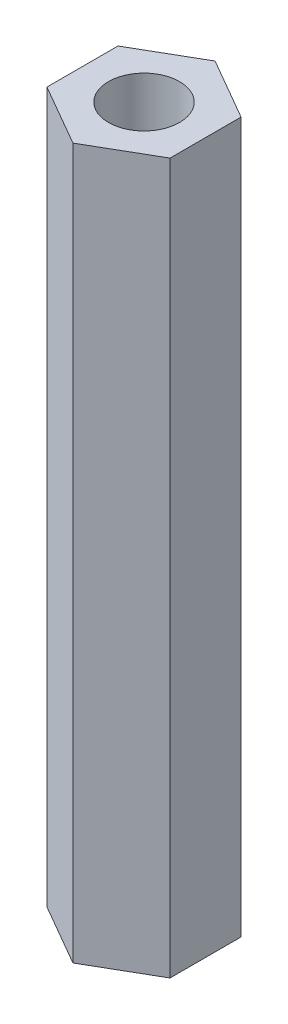
ISO-10303-21;
HEADER;
FILE_DESCRIPTION(('STEP AP214'),'2;1');
FILE_NAME('part.step','',(''),(''),'','','');
FILE_SCHEMA(('AUTOMOTIVE_DESIGN { 1 0 10303 214 1 1 1 1 }'));
ENDSEC;
DATA;
#1=APPLICATION_CONTEXT('core data for automotive mechanical design processes');
#2=APPLICATION_PROTOCOL_DEFINITION('international standard','automotive_design',2000,#1);
#3=PRODUCT_CONTEXT('',#1,'mechanical');
#4=PRODUCT('Part','Part','',(#3));
#5=PRODUCT_RELATED_PRODUCT_CATEGORY('part','',(#4));
#6=PRODUCT_DEFINITION_FORMATION('','',#4);
#7=PRODUCT_DEFINITION_CONTEXT('part definition',#1,'design');
#8=PRODUCT_DEFINITION('design','',#6,#7);
#9=PRODUCT_DEFINITION_SHAPE('','',#8);
#10=(LENGTH_UNIT() NAMED_UNIT(*) SI_UNIT(.MILLI.,.METRE.));
#11=(NAMED_UNIT(*) PLANE_ANGLE_UNIT() SI_UNIT($,.RADIAN.));
#12=(NAMED_UNIT(*) SI_UNIT($,.STERADIAN.) SOLID_ANGLE_UNIT());
#13=UNCERTAINTY_MEASURE_WITH_UNIT(LENGTH_MEASURE(1.E-05),#10,'distance_accuracy_value','');
#14=(GEOMETRIC_REPRESENTATION_CONTEXT(3) GLOBAL_UNCERTAINTY_ASSIGNED_CONTEXT((#13)) GLOBAL_UNIT_ASSIGNED_CONTEXT((#10,
#11,#12)) REPRESENTATION_CONTEXT('',''));
#15=CARTESIAN_POINT('',(0.,0.,0.));
#16=DIRECTION('',(0.,0.,1.));
#17=DIRECTION('',(1.,0.,0.));
#18=AXIS2_PLACEMENT_3D('',#15,#16,#17);
#19=CARTESIAN_POINT('',(0.,30.,0.));
#20=DIRECTION('',(0.,1.,0.));
#21=DIRECTION('',(0.,0.,1.));
#22=AXIS2_PLACEMENT_3D('',#19,#20,#21);
#23=PLANE('',#22);
#24=DIRECTION('',(-0.866025403784439,0.,-0.499999999999999));
#25=VECTOR('',#24,1.);
#26=CARTESIAN_POINT('',(2.6,30.,-1.50111069989303));
#27=LINE('',#26,#25);
#28=CARTESIAN_POINT('',(2.6,30.,-1.50111069989303));
#29=VERTEX_POINT('',#28);
#30=CARTESIAN_POINT('',(0.,30.,-3.00222139978605));
#31=VERTEX_POINT('',#30);
#32=EDGE_CURVE('E150',#29,#31,#27,.T.);
#33=ORIENTED_EDGE('',*,*,#32,.T.);
#34=DIRECTION('',(-0.866025403784438,0.,0.500000000000001));
#35=VECTOR('',#34,1.);
#36=CARTESIAN_POINT('',(0.,30.,-3.00222139978605));
#37=LINE('',#36,#35);
#38=CARTESIAN_POINT('',(-2.6,30.,-1.50111069989303));
#39=VERTEX_POINT('',#38);
#40=EDGE_CURVE('E98',#31,#39,#37,.T.);
#41=ORIENTED_EDGE('',*,*,#40,.T.);
#42=DIRECTION('',(0.,0.,1.));
#43=VECTOR('',#42,1.);
#44=CARTESIAN_POINT('',(-2.6,30.,-1.50111069989303));
#45=LINE('',#44,#43);
#46=CARTESIAN_POINT('',(-2.6,30.,1.50111069989303));
#47=VERTEX_POINT('',#46);
#48=EDGE_CURVE('E111',#39,#47,#45,.T.);
#49=ORIENTED_EDGE('',*,*,#48,.T.);
#50=DIRECTION('',(0.866025403784437,0.,0.500000000000003));
#51=VECTOR('',#50,1.);
#52=CARTESIAN_POINT('',(-2.6,30.,1.50111069989303));
#53=LINE('',#52,#51);
#54=CARTESIAN_POINT('',(0.,30.,3.00222139978606));
#55=VERTEX_POINT('',#54);
#56=EDGE_CURVE('E105',#47,#55,#53,.T.);
#57=ORIENTED_EDGE('',*,*,#56,.T.);
#58=DIRECTION('',(0.866025403784438,0.,-0.5));
#59=VECTOR('',#58,1.);
#60=CARTESIAN_POINT('',(0.,30.,3.00222139978606));
#61=LINE('',#60,#59);
#62=CARTESIAN_POINT('',(2.6,30.,1.50111069989303));
#63=VERTEX_POINT('',#62);
#64=EDGE_CURVE('E109',#55,#63,#61,.T.);
#65=ORIENTED_EDGE('',*,*,#64,.T.);
#66=DIRECTION('',(0.,0.,-1.));
#67=VECTOR('',#66,1.);
#68=CARTESIAN_POINT('',(2.6,30.,1.50111069989303));
#69=LINE('',#68,#67);
#70=EDGE_CURVE('E61',#63,#29,#69,.T.);
#71=ORIENTED_EDGE('',*,*,#70,.T.);
#72=EDGE_LOOP('',(#33,#41,#49,#57,#65,#71));
#73=FACE_BOUND('',#72,.T.);
#74=CARTESIAN_POINT('',(0.,30.,0.));
#75=DIRECTION('',(0.,1.,0.));
#76=DIRECTION('',(0.,0.,1.));
#77=AXIS2_PLACEMENT_3D('',#74,#75,#76);
#78=CIRCLE('',#77,1.5);
#79=CARTESIAN_POINT('',(0.,30.,1.5));
#80=VERTEX_POINT('',#79);
#81=EDGE_CURVE('E138',#80,#80,#78,.T.);
#82=ORIENTED_EDGE('',*,*,#81,.F.);
#83=EDGE_LOOP('',(#82));
#84=FACE_BOUND('',#83,.T.);
#85=ADVANCED_FACE('F43',(#73,#84),#23,.T.);
#86=CARTESIAN_POINT('',(0.,0.,0.));
#87=DIRECTION('',(0.,1.,0.));
#88=DIRECTION('',(0.,0.,1.));
#89=AXIS2_PLACEMENT_3D('',#86,#87,#88);
#90=PLANE('',#89);
#91=DIRECTION('',(-0.866025403784439,0.,-0.499999999999999));
#92=VECTOR('',#91,1.);
#93=CARTESIAN_POINT('',(2.6,0.,-1.50111069989303));
#94=LINE('',#93,#92);
#95=CARTESIAN_POINT('',(2.6,0.,-1.50111069989303));
#96=VERTEX_POINT('',#95);
#97=CARTESIAN_POINT('',(0.,0.,-3.00222139978605));
#98=VERTEX_POINT('',#97);
#99=EDGE_CURVE('E133',#96,#98,#94,.T.);
#100=ORIENTED_EDGE('',*,*,#99,.F.);
#101=DIRECTION('',(0.,0.,-1.));
#102=VECTOR('',#101,1.);
#103=CARTESIAN_POINT('',(2.6,0.,1.50111069989303));
#104=LINE('',#103,#102);
#105=CARTESIAN_POINT('',(2.6,0.,1.50111069989303));
#106=VERTEX_POINT('',#105);
#107=EDGE_CURVE('E90',#106,#96,#104,.T.);
#108=ORIENTED_EDGE('',*,*,#107,.F.);
#109=DIRECTION('',(0.866025403784438,0.,-0.5));
#110=VECTOR('',#109,1.);
#111=CARTESIAN_POINT('',(0.,0.,3.00222139978606));
#112=LINE('',#111,#110);
#113=CARTESIAN_POINT('',(0.,0.,3.00222139978606));
#114=VERTEX_POINT('',#113);
#115=EDGE_CURVE('E84',#114,#106,#112,.T.);
#116=ORIENTED_EDGE('',*,*,#115,.F.);
#117=DIRECTION('',(0.866025403784437,0.,0.500000000000003));
#118=VECTOR('',#117,1.);
#119=CARTESIAN_POINT('',(-2.6,0.,1.50111069989303));
#120=LINE('',#119,#118);
#121=CARTESIAN_POINT('',(-2.6,0.,1.50111069989303));
#122=VERTEX_POINT('',#121);
#123=EDGE_CURVE('E120',#122,#114,#120,.T.);
#124=ORIENTED_EDGE('',*,*,#123,.F.);
#125=DIRECTION('',(0.,0.,1.));
#126=VECTOR('',#125,1.);
#127=CARTESIAN_POINT('',(-2.6,0.,-1.50111069989303));
#128=LINE('',#127,#126);
#129=CARTESIAN_POINT('',(-2.6,0.,-1.50111069989303));
#130=VERTEX_POINT('',#129);
#131=EDGE_CURVE('E141',#130,#122,#128,.T.);
#132=ORIENTED_EDGE('',*,*,#131,.F.);
#133=DIRECTION('',(-0.866025403784438,0.,0.500000000000001));
#134=VECTOR('',#133,1.);
#135=CARTESIAN_POINT('',(0.,0.,-3.00222139978605));
#136=LINE('',#135,#134);
#137=EDGE_CURVE('E137',#98,#130,#136,.T.);
#138=ORIENTED_EDGE('',*,*,#137,.F.);
#139=EDGE_LOOP('',(#100,#108,#116,#124,#132,#138));
#140=FACE_BOUND('',#139,.T.);
#141=CARTESIAN_POINT('',(0.,0.,0.));
#142=DIRECTION('',(0.,1.,0.));
#143=DIRECTION('',(0.,0.,1.));
#144=AXIS2_PLACEMENT_3D('',#141,#142,#143);
#145=CIRCLE('',#144,1.5);
#146=CARTESIAN_POINT('',(0.,0.,1.5));
#147=VERTEX_POINT('',#146);
#148=EDGE_CURVE('E265',#147,#147,#145,.T.);
#149=ORIENTED_EDGE('',*,*,#148,.T.);
#150=EDGE_LOOP('',(#149));
#151=FACE_BOUND('',#150,.T.);
#152=ADVANCED_FACE('F163',(#140,#151),#90,.F.);
#153=CARTESIAN_POINT('',(2.6,30.,-1.50111069989303));
#154=DIRECTION('',(-0.499999999999999,0.,0.866025403784439));
#155=DIRECTION('',(0.866025403784439,0.,0.499999999999999));
#156=AXIS2_PLACEMENT_3D('',#153,#154,#155);
#157=PLANE('',#156);
#158=ORIENTED_EDGE('',*,*,#99,.T.);
#159=DIRECTION('',(0.,-1.,0.));
#160=VECTOR('',#159,1.);
#161=CARTESIAN_POINT('',(0.,30.,-3.00222139978605));
#162=LINE('',#161,#160);
#163=EDGE_CURVE('E11',#31,#98,#162,.T.);
#164=ORIENTED_EDGE('',*,*,#163,.F.);
#165=ORIENTED_EDGE('',*,*,#32,.F.);
#166=DIRECTION('',(0.,-1.,0.));
#167=VECTOR('',#166,1.);
#168=CARTESIAN_POINT('',(2.6,30.,-1.50111069989303));
#169=LINE('',#168,#167);
#170=EDGE_CURVE('E129',#29,#96,#169,.T.);
#171=ORIENTED_EDGE('',*,*,#170,.T.);
#172=EDGE_LOOP('',(#158,#164,#165,#171));
#173=FACE_BOUND('',#172,.T.);
#174=ADVANCED_FACE('F45',(#173),#157,.F.);
#175=CARTESIAN_POINT('',(0.,30.,-3.00222139978605));
#176=DIRECTION('',(0.500000000000001,0.,0.866025403784438));
#177=DIRECTION('',(0.866025403784438,0.,-0.500000000000001));
#178=AXIS2_PLACEMENT_3D('',#175,#176,#177);
#179=PLANE('',#178);
#180=ORIENTED_EDGE('',*,*,#137,.T.);
#181=DIRECTION('',(0.,-1.,0.));
#182=VECTOR('',#181,1.);
#183=CARTESIAN_POINT('',(-2.6,30.,-1.50111069989303));
#184=LINE('',#183,#182);
#185=EDGE_CURVE('E53',#39,#130,#184,.T.);
#186=ORIENTED_EDGE('',*,*,#185,.F.);
#187=ORIENTED_EDGE('',*,*,#40,.F.);
#188=ORIENTED_EDGE('',*,*,#163,.T.);
#189=EDGE_LOOP('',(#180,#186,#187,#188));
#190=FACE_BOUND('',#189,.T.);
#191=ADVANCED_FACE('F188',(#190),#179,.F.);
#192=CARTESIAN_POINT('',(-2.6,30.,-1.50111069989303));
#193=DIRECTION('',(1.,0.,0.));
#194=DIRECTION('',(0.,0.,-1.));
#195=AXIS2_PLACEMENT_3D('',#192,#193,#194);
#196=PLANE('',#195);
#197=ORIENTED_EDGE('',*,*,#131,.T.);
#198=DIRECTION('',(0.,-1.,0.));
#199=VECTOR('',#198,1.);
#200=CARTESIAN_POINT('',(-2.6,30.,1.50111069989303));
#201=LINE('',#200,#199);
#202=EDGE_CURVE('E122',#47,#122,#201,.T.);
#203=ORIENTED_EDGE('',*,*,#202,.F.);
#204=ORIENTED_EDGE('',*,*,#48,.F.);
#205=ORIENTED_EDGE('',*,*,#185,.T.);
#206=EDGE_LOOP('',(#197,#203,#204,#205));
#207=FACE_BOUND('',#206,.T.);
#208=ADVANCED_FACE('F160',(#207),#196,.F.);
#209=CARTESIAN_POINT('',(-2.6,30.,1.50111069989303));
#210=DIRECTION('',(0.500000000000003,0.,-0.866025403784437));
#211=DIRECTION('',(-0.866025403784437,0.,-0.500000000000003));
#212=AXIS2_PLACEMENT_3D('',#209,#210,#211);
#213=PLANE('',#212);
#214=ORIENTED_EDGE('',*,*,#123,.T.);
#215=DIRECTION('',(0.,-1.,0.));
#216=VECTOR('',#215,1.);
#217=CARTESIAN_POINT('',(0.,30.,3.00222139978606));
#218=LINE('',#217,#216);
#219=EDGE_CURVE('E117',#55,#114,#218,.T.);
#220=ORIENTED_EDGE('',*,*,#219,.F.);
#221=ORIENTED_EDGE('',*,*,#56,.F.);
#222=ORIENTED_EDGE('',*,*,#202,.T.);
#223=EDGE_LOOP('',(#214,#220,#221,#222));
#224=FACE_BOUND('',#223,.T.);
#225=ADVANCED_FACE('F118',(#224),#213,.F.);
#226=CARTESIAN_POINT('',(0.,30.,3.00222139978606));
#227=DIRECTION('',(-0.5,0.,-0.866025403784438));
#228=DIRECTION('',(-0.866025403784439,0.,0.5));
#229=AXIS2_PLACEMENT_3D('',#226,#227,#228);
#230=PLANE('',#229);
#231=ORIENTED_EDGE('',*,*,#115,.T.);
#232=DIRECTION('',(0.,-1.,0.));
#233=VECTOR('',#232,1.);
#234=CARTESIAN_POINT('',(2.6,30.,1.50111069989303));
#235=LINE('',#234,#233);
#236=EDGE_CURVE('E123',#63,#106,#235,.T.);
#237=ORIENTED_EDGE('',*,*,#236,.F.);
#238=ORIENTED_EDGE('',*,*,#64,.F.);
#239=ORIENTED_EDGE('',*,*,#219,.T.);
#240=EDGE_LOOP('',(#231,#237,#238,#239));
#241=FACE_BOUND('',#240,.T.);
#242=ADVANCED_FACE('F125',(#241),#230,.F.);
#243=CARTESIAN_POINT('',(2.6,30.,1.50111069989303));
#244=DIRECTION('',(-1.,0.,0.));
#245=DIRECTION('',(0.,0.,1.));
#246=AXIS2_PLACEMENT_3D('',#243,#244,#245);
#247=PLANE('',#246);
#248=ORIENTED_EDGE('',*,*,#107,.T.);
#249=ORIENTED_EDGE('',*,*,#170,.F.);
#250=ORIENTED_EDGE('',*,*,#70,.F.);
#251=ORIENTED_EDGE('',*,*,#236,.T.);
#252=EDGE_LOOP('',(#248,#249,#250,#251));
#253=FACE_BOUND('',#252,.T.);
#254=ADVANCED_FACE('F168',(#253),#247,.F.);
#255=CARTESIAN_POINT('',(0.,30.,0.));
#256=DIRECTION('',(0.,-1.,0.));
#257=DIRECTION('',(0.,0.,-1.));
#258=AXIS2_PLACEMENT_3D('',#255,#256,#257);
#259=CYLINDRICAL_SURFACE('',#258,1.5);
#260=ORIENTED_EDGE('',*,*,#81,.T.);
#261=EDGE_LOOP('',(#260));
#262=FACE_BOUND('',#261,.T.);
#263=ORIENTED_EDGE('',*,*,#148,.F.);
#264=EDGE_LOOP('',(#263));
#265=FACE_BOUND('',#264,.T.);
#266=ADVANCED_FACE('F170',(#262,#265),#259,.F.);
#267=CLOSED_SHELL('',(#85,#152,#174,#191,#208,#225,#242,#254,#266));
#268=MANIFOLD_SOLID_BREP('B2',#267);
#269=ADVANCED_BREP_SHAPE_REPRESENTATION('',(#18,#268),#14);
#270=SHAPE_DEFINITION_REPRESENTATION(#9,#269);
ENDSEC;
END-ISO-10303-21;
